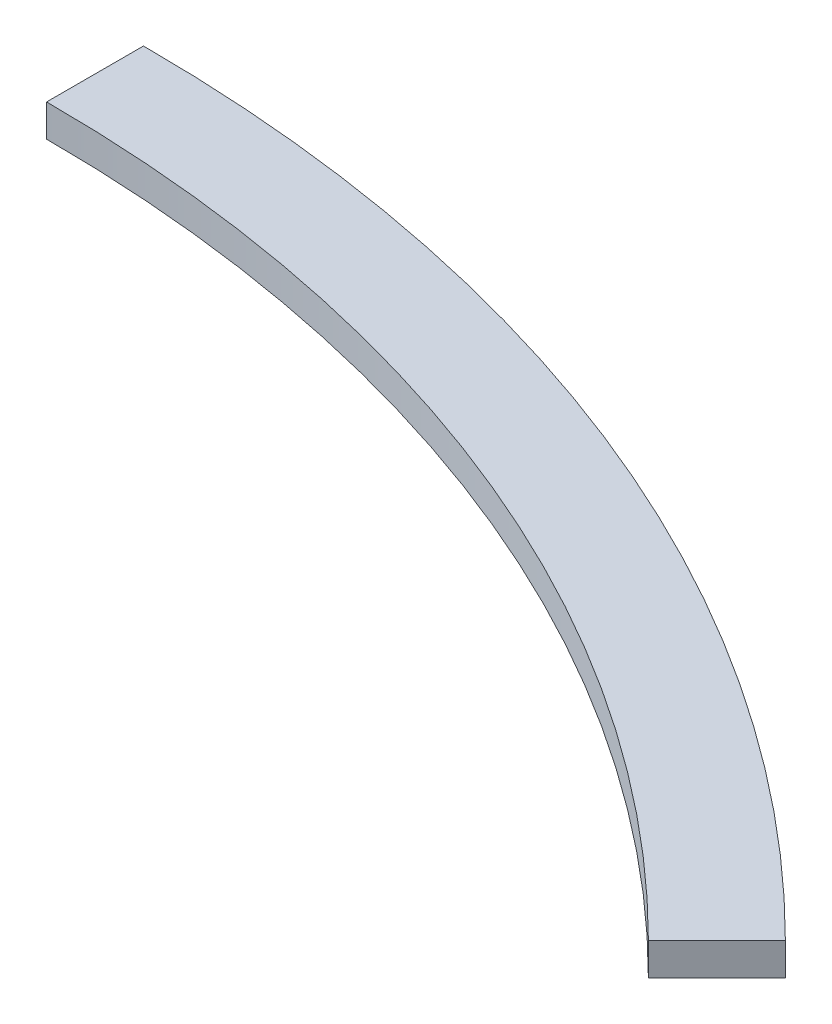
ISO-10303-21;
HEADER;
FILE_DESCRIPTION(('STEP AP214'),'2;1');
FILE_NAME('part.step','',(''),(''),'','','');
FILE_SCHEMA(('AUTOMOTIVE_DESIGN { 1 0 10303 214 1 1 1 1 }'));
ENDSEC;
DATA;
#1=APPLICATION_CONTEXT('core data for automotive mechanical design processes');
#2=APPLICATION_PROTOCOL_DEFINITION('international standard','automotive_design',2000,#1);
#3=PRODUCT_CONTEXT('',#1,'mechanical');
#4=PRODUCT('Part','Part','',(#3));
#5=PRODUCT_RELATED_PRODUCT_CATEGORY('part','',(#4));
#6=PRODUCT_DEFINITION_FORMATION('','',#4);
#7=PRODUCT_DEFINITION_CONTEXT('part definition',#1,'design');
#8=PRODUCT_DEFINITION('design','',#6,#7);
#9=PRODUCT_DEFINITION_SHAPE('','',#8);
#10=(LENGTH_UNIT() NAMED_UNIT(*) SI_UNIT(.MILLI.,.METRE.));
#11=(NAMED_UNIT(*) PLANE_ANGLE_UNIT() SI_UNIT($,.RADIAN.));
#12=(NAMED_UNIT(*) SI_UNIT($,.STERADIAN.) SOLID_ANGLE_UNIT());
#13=UNCERTAINTY_MEASURE_WITH_UNIT(LENGTH_MEASURE(1.E-05),#10,'distance_accuracy_value','');
#14=(GEOMETRIC_REPRESENTATION_CONTEXT(3) GLOBAL_UNCERTAINTY_ASSIGNED_CONTEXT((#13)) GLOBAL_UNIT_ASSIGNED_CONTEXT((#10,
#11,#12)) REPRESENTATION_CONTEXT('',''));
#15=CARTESIAN_POINT('',(0.,0.,0.));
#16=DIRECTION('',(0.,0.,1.));
#17=DIRECTION('',(1.,0.,0.));
#18=AXIS2_PLACEMENT_3D('',#15,#16,#17);
#19=CARTESIAN_POINT('',(0.,10.,0.));
#20=DIRECTION('',(0.,-1.,0.));
#21=DIRECTION('',(0.,0.,-1.));
#22=AXIS2_PLACEMENT_3D('',#19,#20,#21);
#23=CYLINDRICAL_SURFACE('',#22,480.);
#24=CARTESIAN_POINT('',(0.,0.,0.));
#25=DIRECTION('',(0.,1.,0.));
#26=DIRECTION('',(0.,0.,1.));
#27=AXIS2_PLACEMENT_3D('',#24,#25,#26);
#28=CIRCLE('',#27,480.);
#29=CARTESIAN_POINT('',(0.,0.,-480.));
#30=VERTEX_POINT('',#29);
#31=CARTESIAN_POINT('',(339.411254969543,0.,-339.411254969542));
#32=VERTEX_POINT('',#31);
#33=EDGE_CURVE('E97',#30,#32,#28,.F.);
#34=ORIENTED_EDGE('',*,*,#33,.F.);
#35=DIRECTION('',(0.,-1.,0.));
#36=VECTOR('',#35,1.);
#37=CARTESIAN_POINT('',(0.,10.,-480.));
#38=LINE('',#37,#36);
#39=CARTESIAN_POINT('',(0.,10.,-480.));
#40=VERTEX_POINT('',#39);
#41=EDGE_CURVE('E11',#40,#30,#38,.T.);
#42=ORIENTED_EDGE('',*,*,#41,.F.);
#43=CARTESIAN_POINT('',(0.,10.,0.));
#44=DIRECTION('',(0.,1.,0.));
#45=DIRECTION('',(0.,0.,1.));
#46=AXIS2_PLACEMENT_3D('',#43,#44,#45);
#47=CIRCLE('',#46,480.);
#48=CARTESIAN_POINT('',(339.411254969543,10.,-339.411254969542));
#49=VERTEX_POINT('',#48);
#50=EDGE_CURVE('E91',#40,#49,#47,.F.);
#51=ORIENTED_EDGE('',*,*,#50,.T.);
#52=DIRECTION('',(0.,-1.,0.));
#53=VECTOR('',#52,1.);
#54=CARTESIAN_POINT('',(339.411254969543,10.,-339.411254969542));
#55=LINE('',#54,#53);
#56=EDGE_CURVE('E72',#49,#32,#55,.T.);
#57=ORIENTED_EDGE('',*,*,#56,.T.);
#58=EDGE_LOOP('',(#34,#42,#51,#57));
#59=FACE_BOUND('',#58,.T.);
#60=ADVANCED_FACE('F34',(#59),#23,.T.);
#61=CARTESIAN_POINT('',(0.,10.,0.));
#62=DIRECTION('',(-1.,0.,0.));
#63=DIRECTION('',(0.,0.,1.));
#64=AXIS2_PLACEMENT_3D('',#61,#62,#63);
#65=PLANE('',#64);
#66=DIRECTION('',(0.,0.,-1.));
#67=VECTOR('',#66,1.);
#68=CARTESIAN_POINT('',(0.,0.,0.));
#69=LINE('',#68,#67);
#70=CARTESIAN_POINT('',(0.,0.,-450.));
#71=VERTEX_POINT('',#70);
#72=EDGE_CURVE('E85',#71,#30,#69,.T.);
#73=ORIENTED_EDGE('',*,*,#72,.F.);
#74=DIRECTION('',(0.,-1.,0.));
#75=VECTOR('',#74,1.);
#76=CARTESIAN_POINT('',(0.,10.,-450.));
#77=LINE('',#76,#75);
#78=CARTESIAN_POINT('',(0.,10.,-450.));
#79=VERTEX_POINT('',#78);
#80=EDGE_CURVE('E42',#79,#71,#77,.T.);
#81=ORIENTED_EDGE('',*,*,#80,.F.);
#82=DIRECTION('',(0.,0.,-1.));
#83=VECTOR('',#82,1.);
#84=CARTESIAN_POINT('',(0.,10.,0.));
#85=LINE('',#84,#83);
#86=EDGE_CURVE('E83',#79,#40,#85,.T.);
#87=ORIENTED_EDGE('',*,*,#86,.T.);
#88=ORIENTED_EDGE('',*,*,#41,.T.);
#89=EDGE_LOOP('',(#73,#81,#87,#88));
#90=FACE_BOUND('',#89,.T.);
#91=ADVANCED_FACE('F81',(#90),#65,.T.);
#92=CARTESIAN_POINT('',(0.,10.,0.));
#93=DIRECTION('',(0.,-1.,0.));
#94=DIRECTION('',(0.,0.,-1.));
#95=AXIS2_PLACEMENT_3D('',#92,#93,#94);
#96=CYLINDRICAL_SURFACE('',#95,450.);
#97=CARTESIAN_POINT('',(0.,0.,0.));
#98=DIRECTION('',(0.,1.,0.));
#99=DIRECTION('',(0.,0.,1.));
#100=AXIS2_PLACEMENT_3D('',#97,#98,#99);
#101=CIRCLE('',#100,450.);
#102=CARTESIAN_POINT('',(318.198051533947,0.,-318.198051533946));
#103=VERTEX_POINT('',#102);
#104=EDGE_CURVE('E65',#71,#103,#101,.F.);
#105=ORIENTED_EDGE('',*,*,#104,.T.);
#106=DIRECTION('',(0.,-1.,0.));
#107=VECTOR('',#106,1.);
#108=CARTESIAN_POINT('',(318.198051533947,10.,-318.198051533946));
#109=LINE('',#108,#107);
#110=CARTESIAN_POINT('',(318.198051533947,10.,-318.198051533946));
#111=VERTEX_POINT('',#110);
#112=EDGE_CURVE('E86',#111,#103,#109,.T.);
#113=ORIENTED_EDGE('',*,*,#112,.F.);
#114=CARTESIAN_POINT('',(0.,10.,0.));
#115=DIRECTION('',(0.,1.,0.));
#116=DIRECTION('',(0.,0.,1.));
#117=AXIS2_PLACEMENT_3D('',#114,#115,#116);
#118=CIRCLE('',#117,450.);
#119=EDGE_CURVE('E87',#79,#111,#118,.F.);
#120=ORIENTED_EDGE('',*,*,#119,.F.);
#121=ORIENTED_EDGE('',*,*,#80,.T.);
#122=EDGE_LOOP('',(#105,#113,#120,#121));
#123=FACE_BOUND('',#122,.T.);
#124=ADVANCED_FACE('F88',(#123),#96,.F.);
#125=CARTESIAN_POINT('',(0.,10.,0.));
#126=DIRECTION('',(-0.707106781186547,0.,-0.707106781186548));
#127=DIRECTION('',(-0.707106781186548,0.,0.707106781186547));
#128=AXIS2_PLACEMENT_3D('',#125,#126,#127);
#129=PLANE('',#128);
#130=DIRECTION('',(0.707106781186548,0.,-0.707106781186547));
#131=VECTOR('',#130,1.);
#132=CARTESIAN_POINT('',(0.,0.,0.));
#133=LINE('',#132,#131);
#134=EDGE_CURVE('E93',#103,#32,#133,.T.);
#135=ORIENTED_EDGE('',*,*,#134,.T.);
#136=ORIENTED_EDGE('',*,*,#56,.F.);
#137=DIRECTION('',(0.707106781186548,0.,-0.707106781186547));
#138=VECTOR('',#137,1.);
#139=CARTESIAN_POINT('',(0.,10.,0.));
#140=LINE('',#139,#138);
#141=EDGE_CURVE('E50',#111,#49,#140,.T.);
#142=ORIENTED_EDGE('',*,*,#141,.F.);
#143=ORIENTED_EDGE('',*,*,#112,.T.);
#144=EDGE_LOOP('',(#135,#136,#142,#143));
#145=FACE_BOUND('',#144,.T.);
#146=ADVANCED_FACE('F106',(#145),#129,.F.);
#147=CARTESIAN_POINT('',(0.,10.,0.));
#148=DIRECTION('',(0.,1.,0.));
#149=DIRECTION('',(0.,0.,1.));
#150=AXIS2_PLACEMENT_3D('',#147,#148,#149);
#151=PLANE('',#150);
#152=ORIENTED_EDGE('',*,*,#50,.F.);
#153=ORIENTED_EDGE('',*,*,#86,.F.);
#154=ORIENTED_EDGE('',*,*,#119,.T.);
#155=ORIENTED_EDGE('',*,*,#141,.T.);
#156=EDGE_LOOP('',(#152,#153,#154,#155));
#157=FACE_BOUND('',#156,.T.);
#158=ADVANCED_FACE('F90',(#157),#151,.T.);
#159=CARTESIAN_POINT('',(0.,0.,0.));
#160=DIRECTION('',(0.,1.,0.));
#161=DIRECTION('',(0.,0.,1.));
#162=AXIS2_PLACEMENT_3D('',#159,#160,#161);
#163=PLANE('',#162);
#164=ORIENTED_EDGE('',*,*,#33,.T.);
#165=ORIENTED_EDGE('',*,*,#134,.F.);
#166=ORIENTED_EDGE('',*,*,#104,.F.);
#167=ORIENTED_EDGE('',*,*,#72,.T.);
#168=EDGE_LOOP('',(#164,#165,#166,#167));
#169=FACE_BOUND('',#168,.T.);
#170=ADVANCED_FACE('F108',(#169),#163,.F.);
#171=CLOSED_SHELL('',(#60,#91,#124,#146,#158,#170));
#172=MANIFOLD_SOLID_BREP('B2',#171);
#173=ADVANCED_BREP_SHAPE_REPRESENTATION('',(#18,#172),#14);
#174=SHAPE_DEFINITION_REPRESENTATION(#9,#173);
ENDSEC;
END-ISO-10303-21;
